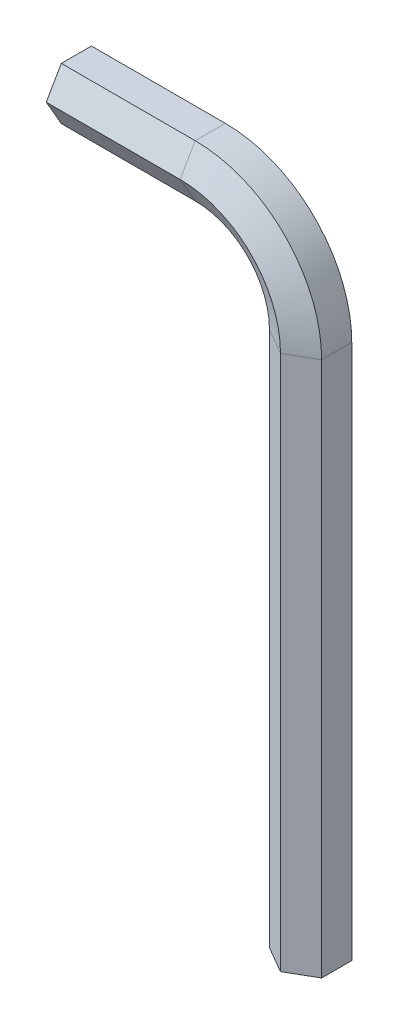
ISO-10303-21;
HEADER;
FILE_DESCRIPTION(('STEP AP214'),'2;1');
FILE_NAME('part.step','',(''),(''),'','','');
FILE_SCHEMA(('AUTOMOTIVE_DESIGN { 1 0 10303 214 1 1 1 1 }'));
ENDSEC;
DATA;
#1=APPLICATION_CONTEXT('core data for automotive mechanical design processes');
#2=APPLICATION_PROTOCOL_DEFINITION('international standard','automotive_design',2000,#1);
#3=PRODUCT_CONTEXT('',#1,'mechanical');
#4=PRODUCT('Part','Part','',(#3));
#5=PRODUCT_RELATED_PRODUCT_CATEGORY('part','',(#4));
#6=PRODUCT_DEFINITION_FORMATION('','',#4);
#7=PRODUCT_DEFINITION_CONTEXT('part definition',#1,'design');
#8=PRODUCT_DEFINITION('design','',#6,#7);
#9=PRODUCT_DEFINITION_SHAPE('','',#8);
#10=(LENGTH_UNIT() NAMED_UNIT(*) SI_UNIT(.MILLI.,.METRE.));
#11=(NAMED_UNIT(*) PLANE_ANGLE_UNIT() SI_UNIT($,.RADIAN.));
#12=(NAMED_UNIT(*) SI_UNIT($,.STERADIAN.) SOLID_ANGLE_UNIT());
#13=UNCERTAINTY_MEASURE_WITH_UNIT(LENGTH_MEASURE(1.E-05),#10,'distance_accuracy_value','');
#14=(GEOMETRIC_REPRESENTATION_CONTEXT(3) GLOBAL_UNCERTAINTY_ASSIGNED_CONTEXT((#13)) GLOBAL_UNIT_ASSIGNED_CONTEXT((#10,
#11,#12)) REPRESENTATION_CONTEXT('',''));
#15=CARTESIAN_POINT('',(0.,0.,0.));
#16=DIRECTION('',(0.,0.,1.));
#17=DIRECTION('',(1.,0.,0.));
#18=AXIS2_PLACEMENT_3D('',#15,#16,#17);
#19=CARTESIAN_POINT('',(-95.,0.,0.));
#20=DIRECTION('',(0.,1.,0.));
#21=DIRECTION('',(0.,0.,1.));
#22=AXIS2_PLACEMENT_3D('',#19,#20,#21);
#23=PLANE('',#22);
#24=DIRECTION('',(0.866025403784439,0.,0.5));
#25=VECTOR('',#24,1.);
#26=CARTESIAN_POINT('',(-3.89711431702998,0.,2.24999999999999));
#27=LINE('',#26,#25);
#28=CARTESIAN_POINT('',(-3.89711431702998,0.,2.24999999999999));
#29=VERTEX_POINT('',#28);
#30=CARTESIAN_POINT('',(0.,0.,4.49999999999999));
#31=VERTEX_POINT('',#30);
#32=EDGE_CURVE('E196',#29,#31,#27,.T.);
#33=ORIENTED_EDGE('',*,*,#32,.F.);
#34=DIRECTION('',(0.,0.,1.));
#35=VECTOR('',#34,1.);
#36=CARTESIAN_POINT('',(-3.89711431702997,0.,-2.25));
#37=LINE('',#36,#35);
#38=CARTESIAN_POINT('',(-3.89711431702997,0.,-2.25));
#39=VERTEX_POINT('',#38);
#40=EDGE_CURVE('E258',#39,#29,#37,.T.);
#41=ORIENTED_EDGE('',*,*,#40,.F.);
#42=DIRECTION('',(-0.866025403784438,0.,0.5));
#43=VECTOR('',#42,1.);
#44=CARTESIAN_POINT('',(0.,0.,-4.5));
#45=LINE('',#44,#43);
#46=CARTESIAN_POINT('',(0.,0.,-4.5));
#47=VERTEX_POINT('',#46);
#48=EDGE_CURVE('E238',#47,#39,#45,.T.);
#49=ORIENTED_EDGE('',*,*,#48,.F.);
#50=DIRECTION('',(-0.866025403784439,0.,-0.499999999999999));
#51=VECTOR('',#50,1.);
#52=CARTESIAN_POINT('',(3.89711431702998,0.,-2.25));
#53=LINE('',#52,#51);
#54=CARTESIAN_POINT('',(3.89711431702998,0.,-2.25));
#55=VERTEX_POINT('',#54);
#56=EDGE_CURVE('E142',#55,#47,#53,.T.);
#57=ORIENTED_EDGE('',*,*,#56,.F.);
#58=DIRECTION('',(0.,0.,-1.));
#59=VECTOR('',#58,1.);
#60=CARTESIAN_POINT('',(3.89711431702997,0.,2.25));
#61=LINE('',#60,#59);
#62=CARTESIAN_POINT('',(3.89711431702997,0.,2.25));
#63=VERTEX_POINT('',#62);
#64=EDGE_CURVE('E146',#63,#55,#61,.T.);
#65=ORIENTED_EDGE('',*,*,#64,.F.);
#66=DIRECTION('',(0.866025403784438,0.,-0.5));
#67=VECTOR('',#66,1.);
#68=CARTESIAN_POINT('',(0.,0.,4.49999999999999));
#69=LINE('',#68,#67);
#70=EDGE_CURVE('E151',#31,#63,#69,.T.);
#71=ORIENTED_EDGE('',*,*,#70,.F.);
#72=EDGE_LOOP('',(#33,#41,#49,#57,#65,#71));
#73=FACE_BOUND('',#72,.T.);
#74=ADVANCED_FACE('F40',(#73),#23,.F.);
#75=CARTESIAN_POINT('',(-35.,0.,0.));
#76=DIRECTION('',(-1.,0.,0.));
#77=DIRECTION('',(0.,0.,1.));
#78=AXIS2_PLACEMENT_3D('',#75,#76,#77);
#79=PLANE('',#78);
#80=DIRECTION('',(0.,0.866025403784439,0.5));
#81=VECTOR('',#80,1.);
#82=CARTESIAN_POINT('',(-35.,91.10288568297,2.24999999999999));
#83=LINE('',#82,#81);
#84=CARTESIAN_POINT('',(-35.,91.10288568297,2.24999999999999));
#85=VERTEX_POINT('',#84);
#86=CARTESIAN_POINT('',(-35.,95.,4.49999999999999));
#87=VERTEX_POINT('',#86);
#88=EDGE_CURVE('E162',#85,#87,#83,.T.);
#89=ORIENTED_EDGE('',*,*,#88,.T.);
#90=DIRECTION('',(0.,0.866025403784438,-0.5));
#91=VECTOR('',#90,1.);
#92=CARTESIAN_POINT('',(-35.,95.,4.49999999999999));
#93=LINE('',#92,#91);
#94=CARTESIAN_POINT('',(-35.,98.89711431703,2.25));
#95=VERTEX_POINT('',#94);
#96=EDGE_CURVE('E165',#87,#95,#93,.T.);
#97=ORIENTED_EDGE('',*,*,#96,.T.);
#98=DIRECTION('',(0.,0.,-1.));
#99=VECTOR('',#98,1.);
#100=CARTESIAN_POINT('',(-35.,98.89711431703,2.25));
#101=LINE('',#100,#99);
#102=CARTESIAN_POINT('',(-35.,98.89711431703,-2.25));
#103=VERTEX_POINT('',#102);
#104=EDGE_CURVE('E216',#95,#103,#101,.T.);
#105=ORIENTED_EDGE('',*,*,#104,.T.);
#106=DIRECTION('',(0.,-0.866025403784439,-0.499999999999999));
#107=VECTOR('',#106,1.);
#108=CARTESIAN_POINT('',(-35.,98.89711431703,-2.25));
#109=LINE('',#108,#107);
#110=CARTESIAN_POINT('',(-35.,95.,-4.5));
#111=VERTEX_POINT('',#110);
#112=EDGE_CURVE('E60',#103,#111,#109,.T.);
#113=ORIENTED_EDGE('',*,*,#112,.T.);
#114=DIRECTION('',(0.,-0.866025403784438,0.5));
#115=VECTOR('',#114,1.);
#116=CARTESIAN_POINT('',(-35.,95.,-4.5));
#117=LINE('',#116,#115);
#118=CARTESIAN_POINT('',(-35.,91.10288568297,-2.25));
#119=VERTEX_POINT('',#118);
#120=EDGE_CURVE('E54',#111,#119,#117,.T.);
#121=ORIENTED_EDGE('',*,*,#120,.T.);
#122=DIRECTION('',(0.,0.,1.));
#123=VECTOR('',#122,1.);
#124=CARTESIAN_POINT('',(-35.,91.10288568297,-2.25));
#125=LINE('',#124,#123);
#126=EDGE_CURVE('E11',#119,#85,#125,.T.);
#127=ORIENTED_EDGE('',*,*,#126,.T.);
#128=EDGE_LOOP('',(#89,#97,#105,#113,#121,#127));
#129=FACE_BOUND('',#128,.T.);
#130=ADVANCED_FACE('F164',(#129),#79,.T.);
#131=CARTESIAN_POINT('',(-3.89711431702998,0.,2.24999999999999));
#132=DIRECTION('',(-0.5,0.,0.866025403784439));
#133=DIRECTION('',(0.866025403784439,0.,0.5));
#134=AXIS2_PLACEMENT_3D('',#131,#132,#133);
#135=PLANE('',#134);
#136=DIRECTION('',(0.,1.,0.));
#137=VECTOR('',#136,1.);
#138=CARTESIAN_POINT('',(0.,0.,4.49999999999999));
#139=LINE('',#138,#137);
#140=CARTESIAN_POINT('',(0.,80.,4.49999999999999));
#141=VERTEX_POINT('',#140);
#142=EDGE_CURVE('E202',#31,#141,#139,.T.);
#143=ORIENTED_EDGE('',*,*,#142,.T.);
#144=DIRECTION('',(0.866025403784439,0.,0.5));
#145=VECTOR('',#144,1.);
#146=CARTESIAN_POINT('',(-3.89711431702998,80.,2.24999999999999));
#147=LINE('',#146,#145);
#148=CARTESIAN_POINT('',(-3.89711431702998,80.,2.24999999999999));
#149=VERTEX_POINT('',#148);
#150=EDGE_CURVE('E305',#149,#141,#147,.T.);
#151=ORIENTED_EDGE('',*,*,#150,.F.);
#152=DIRECTION('',(0.,1.,0.));
#153=VECTOR('',#152,1.);
#154=CARTESIAN_POINT('',(-3.89711431702998,0.,2.24999999999999));
#155=LINE('',#154,#153);
#156=EDGE_CURVE('E279',#29,#149,#155,.T.);
#157=ORIENTED_EDGE('',*,*,#156,.F.);
#158=ORIENTED_EDGE('',*,*,#32,.T.);
#159=EDGE_LOOP('',(#143,#151,#157,#158));
#160=FACE_BOUND('',#159,.T.);
#161=ADVANCED_FACE('F316',(#160),#135,.T.);
#162=CARTESIAN_POINT('',(0.,0.,4.49999999999999));
#163=DIRECTION('',(0.5,0.,0.866025403784438));
#164=DIRECTION('',(0.866025403784438,0.,-0.5));
#165=AXIS2_PLACEMENT_3D('',#162,#163,#164);
#166=PLANE('',#165);
#167=DIRECTION('',(0.,1.,0.));
#168=VECTOR('',#167,1.);
#169=CARTESIAN_POINT('',(3.89711431702997,0.,2.25));
#170=LINE('',#169,#168);
#171=CARTESIAN_POINT('',(3.89711431702997,80.,2.25));
#172=VERTEX_POINT('',#171);
#173=EDGE_CURVE('E201',#63,#172,#170,.T.);
#174=ORIENTED_EDGE('',*,*,#173,.T.);
#175=DIRECTION('',(0.866025403784438,0.,-0.5));
#176=VECTOR('',#175,1.);
#177=CARTESIAN_POINT('',(0.,80.,4.49999999999999));
#178=LINE('',#177,#176);
#179=EDGE_CURVE('E197',#141,#172,#178,.T.);
#180=ORIENTED_EDGE('',*,*,#179,.F.);
#181=ORIENTED_EDGE('',*,*,#142,.F.);
#182=ORIENTED_EDGE('',*,*,#70,.T.);
#183=EDGE_LOOP('',(#174,#180,#181,#182));
#184=FACE_BOUND('',#183,.T.);
#185=ADVANCED_FACE('F319',(#184),#166,.T.);
#186=CARTESIAN_POINT('',(3.89711431702997,0.,2.25));
#187=DIRECTION('',(1.,0.,0.));
#188=DIRECTION('',(0.,0.,-1.));
#189=AXIS2_PLACEMENT_3D('',#186,#187,#188);
#190=PLANE('',#189);
#191=DIRECTION('',(0.,1.,0.));
#192=VECTOR('',#191,1.);
#193=CARTESIAN_POINT('',(3.89711431702998,0.,-2.25));
#194=LINE('',#193,#192);
#195=CARTESIAN_POINT('',(3.89711431702998,80.,-2.25));
#196=VERTEX_POINT('',#195);
#197=EDGE_CURVE('E221',#55,#196,#194,.T.);
#198=ORIENTED_EDGE('',*,*,#197,.T.);
#199=DIRECTION('',(0.,0.,-1.));
#200=VECTOR('',#199,1.);
#201=CARTESIAN_POINT('',(3.89711431702997,80.,2.25));
#202=LINE('',#201,#200);
#203=EDGE_CURVE('E206',#172,#196,#202,.T.);
#204=ORIENTED_EDGE('',*,*,#203,.F.);
#205=ORIENTED_EDGE('',*,*,#173,.F.);
#206=ORIENTED_EDGE('',*,*,#64,.T.);
#207=EDGE_LOOP('',(#198,#204,#205,#206));
#208=FACE_BOUND('',#207,.T.);
#209=ADVANCED_FACE('F373',(#208),#190,.T.);
#210=CARTESIAN_POINT('',(3.89711431702998,0.,-2.25));
#211=DIRECTION('',(0.499999999999999,0.,-0.866025403784439));
#212=DIRECTION('',(-0.866025403784439,0.,-0.499999999999999));
#213=AXIS2_PLACEMENT_3D('',#210,#211,#212);
#214=PLANE('',#213);
#215=DIRECTION('',(0.,1.,0.));
#216=VECTOR('',#215,1.);
#217=CARTESIAN_POINT('',(0.,0.,-4.5));
#218=LINE('',#217,#216);
#219=CARTESIAN_POINT('',(0.,80.,-4.5));
#220=VERTEX_POINT('',#219);
#221=EDGE_CURVE('E241',#47,#220,#218,.T.);
#222=ORIENTED_EDGE('',*,*,#221,.T.);
#223=DIRECTION('',(-0.866025403784439,0.,-0.499999999999999));
#224=VECTOR('',#223,1.);
#225=CARTESIAN_POINT('',(3.89711431702998,80.,-2.25));
#226=LINE('',#225,#224);
#227=EDGE_CURVE('E225',#196,#220,#226,.T.);
#228=ORIENTED_EDGE('',*,*,#227,.F.);
#229=ORIENTED_EDGE('',*,*,#197,.F.);
#230=ORIENTED_EDGE('',*,*,#56,.T.);
#231=EDGE_LOOP('',(#222,#228,#229,#230));
#232=FACE_BOUND('',#231,.T.);
#233=ADVANCED_FACE('F381',(#232),#214,.T.);
#234=CARTESIAN_POINT('',(0.,0.,-4.5));
#235=DIRECTION('',(-0.5,0.,-0.866025403784438));
#236=DIRECTION('',(-0.866025403784438,0.,0.5));
#237=AXIS2_PLACEMENT_3D('',#234,#235,#236);
#238=PLANE('',#237);
#239=DIRECTION('',(0.,1.,0.));
#240=VECTOR('',#239,1.);
#241=CARTESIAN_POINT('',(-3.89711431702997,0.,-2.25));
#242=LINE('',#241,#240);
#243=CARTESIAN_POINT('',(-3.89711431702997,80.,-2.25));
#244=VERTEX_POINT('',#243);
#245=EDGE_CURVE('E261',#39,#244,#242,.T.);
#246=ORIENTED_EDGE('',*,*,#245,.T.);
#247=DIRECTION('',(-0.866025403784438,0.,0.5));
#248=VECTOR('',#247,1.);
#249=CARTESIAN_POINT('',(0.,80.,-4.5));
#250=LINE('',#249,#248);
#251=EDGE_CURVE('E245',#220,#244,#250,.T.);
#252=ORIENTED_EDGE('',*,*,#251,.F.);
#253=ORIENTED_EDGE('',*,*,#221,.F.);
#254=ORIENTED_EDGE('',*,*,#48,.T.);
#255=EDGE_LOOP('',(#246,#252,#253,#254));
#256=FACE_BOUND('',#255,.T.);
#257=ADVANCED_FACE('F391',(#256),#238,.T.);
#258=CARTESIAN_POINT('',(-3.89711431702997,0.,-2.25));
#259=DIRECTION('',(-1.,0.,0.));
#260=DIRECTION('',(0.,0.,1.));
#261=AXIS2_PLACEMENT_3D('',#258,#259,#260);
#262=PLANE('',#261);
#263=DIRECTION('',(0.,0.,1.));
#264=VECTOR('',#263,1.);
#265=CARTESIAN_POINT('',(-3.89711431702997,80.,-2.25));
#266=LINE('',#265,#264);
#267=EDGE_CURVE('E265',#244,#149,#266,.T.);
#268=ORIENTED_EDGE('',*,*,#267,.F.);
#269=ORIENTED_EDGE('',*,*,#245,.F.);
#270=ORIENTED_EDGE('',*,*,#40,.T.);
#271=ORIENTED_EDGE('',*,*,#156,.T.);
#272=EDGE_LOOP('',(#268,#269,#270,#271));
#273=FACE_BOUND('',#272,.T.);
#274=ADVANCED_FACE('F332',(#273),#262,.T.);
#275=CARTESIAN_POINT('',(-15.,80.,2.24999999999999));
#276=DIRECTION('',(0.,0.,1.));
#277=DIRECTION('',(1.,0.,0.));
#278=AXIS2_PLACEMENT_3D('',#275,#276,#277);
#279=CONICAL_SURFACE('',#278,11.10288568297,1.0471975511966);
#280=CARTESIAN_POINT('',(-15.,80.,4.49999999999999));
#281=DIRECTION('',(0.,0.,1.));
#282=DIRECTION('',(1.,0.,0.));
#283=AXIS2_PLACEMENT_3D('',#280,#281,#282);
#284=CIRCLE('',#283,15.);
#285=CARTESIAN_POINT('',(-14.9999999999999,95.,4.49999999999999));
#286=VERTEX_POINT('',#285);
#287=EDGE_CURVE('E210',#141,#286,#284,.T.);
#288=ORIENTED_EDGE('',*,*,#287,.T.);
#289=DIRECTION('',(0.,0.866025403784439,0.5));
#290=VECTOR('',#289,1.);
#291=CARTESIAN_POINT('',(-14.9999999999999,91.1028856829701,2.24999999999999));
#292=LINE('',#291,#290);
#293=CARTESIAN_POINT('',(-14.9999999999999,91.10288568297,2.24999999999999));
#294=VERTEX_POINT('',#293);
#295=EDGE_CURVE('E185',#294,#286,#292,.T.);
#296=ORIENTED_EDGE('',*,*,#295,.F.);
#297=CARTESIAN_POINT('',(-15.,80.,2.24999999999999));
#298=DIRECTION('',(0.,0.,1.));
#299=DIRECTION('',(1.,0.,0.));
#300=AXIS2_PLACEMENT_3D('',#297,#298,#299);
#301=CIRCLE('',#300,11.10288568297);
#302=EDGE_CURVE('E282',#149,#294,#301,.T.);
#303=ORIENTED_EDGE('',*,*,#302,.F.);
#304=ORIENTED_EDGE('',*,*,#150,.T.);
#305=EDGE_LOOP('',(#288,#296,#303,#304));
#306=FACE_BOUND('',#305,.T.);
#307=ADVANCED_FACE('F290',(#306),#279,.F.);
#308=CARTESIAN_POINT('',(-15.,80.,4.49999999999999));
#309=DIRECTION('',(0.,0.,-1.));
#310=DIRECTION('',(-1.,0.,0.));
#311=AXIS2_PLACEMENT_3D('',#308,#309,#310);
#312=CONICAL_SURFACE('',#311,15.,1.0471975511966);
#313=CARTESIAN_POINT('',(-15.,80.,2.25));
#314=DIRECTION('',(0.,0.,1.));
#315=DIRECTION('',(1.,0.,0.));
#316=AXIS2_PLACEMENT_3D('',#313,#314,#315);
#317=CIRCLE('',#316,18.89711431703);
#318=CARTESIAN_POINT('',(-14.9999999999999,98.89711431703,2.25));
#319=VERTEX_POINT('',#318);
#320=EDGE_CURVE('E129',#172,#319,#317,.T.);
#321=ORIENTED_EDGE('',*,*,#320,.T.);
#322=DIRECTION('',(0.,0.866025403784438,-0.5));
#323=VECTOR('',#322,1.);
#324=CARTESIAN_POINT('',(-14.9999999999999,95.,4.49999999999999));
#325=LINE('',#324,#323);
#326=EDGE_CURVE('E207',#286,#319,#325,.T.);
#327=ORIENTED_EDGE('',*,*,#326,.F.);
#328=ORIENTED_EDGE('',*,*,#287,.F.);
#329=ORIENTED_EDGE('',*,*,#179,.T.);
#330=EDGE_LOOP('',(#321,#327,#328,#329));
#331=FACE_BOUND('',#330,.T.);
#332=ADVANCED_FACE('F322',(#331),#312,.T.);
#333=CARTESIAN_POINT('',(-15.,80.,0.));
#334=DIRECTION('',(0.,0.,1.));
#335=DIRECTION('',(1.,0.,0.));
#336=AXIS2_PLACEMENT_3D('',#333,#334,#335);
#337=CYLINDRICAL_SURFACE('',#336,18.89711431703);
#338=CARTESIAN_POINT('',(-15.,80.,-2.25));
#339=DIRECTION('',(0.,0.,1.));
#340=DIRECTION('',(1.,0.,0.));
#341=AXIS2_PLACEMENT_3D('',#338,#339,#340);
#342=CIRCLE('',#341,18.89711431703);
#343=CARTESIAN_POINT('',(-14.9999999999999,98.89711431703,-2.25));
#344=VERTEX_POINT('',#343);
#345=EDGE_CURVE('E120',#196,#344,#342,.T.);
#346=ORIENTED_EDGE('',*,*,#345,.T.);
#347=DIRECTION('',(0.,0.,-1.));
#348=VECTOR('',#347,1.);
#349=CARTESIAN_POINT('',(-14.9999999999999,98.89711431703,2.25));
#350=LINE('',#349,#348);
#351=EDGE_CURVE('E212',#319,#344,#350,.T.);
#352=ORIENTED_EDGE('',*,*,#351,.F.);
#353=ORIENTED_EDGE('',*,*,#320,.F.);
#354=ORIENTED_EDGE('',*,*,#203,.T.);
#355=EDGE_LOOP('',(#346,#352,#353,#354));
#356=FACE_BOUND('',#355,.T.);
#357=ADVANCED_FACE('F324',(#356),#337,.T.);
#358=CARTESIAN_POINT('',(-15.,80.,-2.25));
#359=DIRECTION('',(0.,0.,1.));
#360=DIRECTION('',(1.,0.,0.));
#361=AXIS2_PLACEMENT_3D('',#358,#359,#360);
#362=CONICAL_SURFACE('',#361,18.89711431703,1.0471975511966);
#363=CARTESIAN_POINT('',(-15.,80.,-4.5));
#364=DIRECTION('',(0.,0.,1.));
#365=DIRECTION('',(1.,0.,0.));
#366=AXIS2_PLACEMENT_3D('',#363,#364,#365);
#367=CIRCLE('',#366,15.);
#368=CARTESIAN_POINT('',(-14.9999999999999,95.,-4.5));
#369=VERTEX_POINT('',#368);
#370=EDGE_CURVE('E113',#220,#369,#367,.T.);
#371=ORIENTED_EDGE('',*,*,#370,.T.);
#372=DIRECTION('',(0.,-0.866025403784439,-0.499999999999999));
#373=VECTOR('',#372,1.);
#374=CARTESIAN_POINT('',(-14.9999999999999,98.89711431703,-2.25));
#375=LINE('',#374,#373);
#376=EDGE_CURVE('E231',#344,#369,#375,.T.);
#377=ORIENTED_EDGE('',*,*,#376,.F.);
#378=ORIENTED_EDGE('',*,*,#345,.F.);
#379=ORIENTED_EDGE('',*,*,#227,.T.);
#380=EDGE_LOOP('',(#371,#377,#378,#379));
#381=FACE_BOUND('',#380,.T.);
#382=ADVANCED_FACE('F330',(#381),#362,.T.);
#383=CARTESIAN_POINT('',(-15.,80.,-4.5));
#384=DIRECTION('',(0.,0.,-1.));
#385=DIRECTION('',(-1.,0.,0.));
#386=AXIS2_PLACEMENT_3D('',#383,#384,#385);
#387=CONICAL_SURFACE('',#386,15.,1.0471975511966);
#388=CARTESIAN_POINT('',(-15.,80.,-2.25));
#389=DIRECTION('',(0.,0.,1.));
#390=DIRECTION('',(1.,0.,0.));
#391=AXIS2_PLACEMENT_3D('',#388,#389,#390);
#392=CIRCLE('',#391,11.10288568297);
#393=CARTESIAN_POINT('',(-14.9999999999999,91.10288568297,-2.25));
#394=VERTEX_POINT('',#393);
#395=EDGE_CURVE('E268',#244,#394,#392,.T.);
#396=ORIENTED_EDGE('',*,*,#395,.T.);
#397=DIRECTION('',(0.,-0.866025403784438,0.5));
#398=VECTOR('',#397,1.);
#399=CARTESIAN_POINT('',(-14.9999999999999,95.,-4.5));
#400=LINE('',#399,#398);
#401=EDGE_CURVE('E250',#369,#394,#400,.T.);
#402=ORIENTED_EDGE('',*,*,#401,.F.);
#403=ORIENTED_EDGE('',*,*,#370,.F.);
#404=ORIENTED_EDGE('',*,*,#251,.T.);
#405=EDGE_LOOP('',(#396,#402,#403,#404));
#406=FACE_BOUND('',#405,.T.);
#407=ADVANCED_FACE('F432',(#406),#387,.F.);
#408=CARTESIAN_POINT('',(-15.,80.,0.));
#409=DIRECTION('',(0.,0.,1.));
#410=DIRECTION('',(1.,0.,0.));
#411=AXIS2_PLACEMENT_3D('',#408,#409,#410);
#412=CYLINDRICAL_SURFACE('',#411,11.10288568297);
#413=DIRECTION('',(0.,0.,1.));
#414=VECTOR('',#413,1.);
#415=CARTESIAN_POINT('',(-14.9999999999999,91.1028856829701,-2.25));
#416=LINE('',#415,#414);
#417=EDGE_CURVE('E193',#394,#294,#416,.T.);
#418=ORIENTED_EDGE('',*,*,#417,.F.);
#419=ORIENTED_EDGE('',*,*,#395,.F.);
#420=ORIENTED_EDGE('',*,*,#267,.T.);
#421=ORIENTED_EDGE('',*,*,#302,.T.);
#422=EDGE_LOOP('',(#418,#419,#420,#421));
#423=FACE_BOUND('',#422,.T.);
#424=ADVANCED_FACE('F294',(#423),#412,.F.);
#425=CARTESIAN_POINT('',(-15.,91.10288568297,2.24999999999999));
#426=DIRECTION('',(0.,-0.5,0.866025403784439));
#427=DIRECTION('',(0.,-0.866025403784439,-0.5));
#428=AXIS2_PLACEMENT_3D('',#425,#426,#427);
#429=PLANE('',#428);
#430=DIRECTION('',(-1.,0.,0.));
#431=VECTOR('',#430,1.);
#432=CARTESIAN_POINT('',(-15.,95.,4.49999999999999));
#433=LINE('',#432,#431);
#434=EDGE_CURVE('E171',#286,#87,#433,.T.);
#435=ORIENTED_EDGE('',*,*,#434,.T.);
#436=ORIENTED_EDGE('',*,*,#88,.F.);
#437=DIRECTION('',(-1.,0.,0.));
#438=VECTOR('',#437,1.);
#439=CARTESIAN_POINT('',(-15.,91.10288568297,2.24999999999999));
#440=LINE('',#439,#438);
#441=EDGE_CURVE('E172',#294,#85,#440,.T.);
#442=ORIENTED_EDGE('',*,*,#441,.F.);
#443=ORIENTED_EDGE('',*,*,#295,.T.);
#444=EDGE_LOOP('',(#435,#436,#442,#443));
#445=FACE_BOUND('',#444,.T.);
#446=ADVANCED_FACE('F183',(#445),#429,.T.);
#447=CARTESIAN_POINT('',(-15.,95.,4.49999999999999));
#448=DIRECTION('',(0.,0.5,0.866025403784438));
#449=DIRECTION('',(0.,-0.866025403784438,0.5));
#450=AXIS2_PLACEMENT_3D('',#447,#448,#449);
#451=PLANE('',#450);
#452=DIRECTION('',(-1.,0.,0.));
#453=VECTOR('',#452,1.);
#454=CARTESIAN_POINT('',(-15.,98.89711431703,2.25));
#455=LINE('',#454,#453);
#456=EDGE_CURVE('E179',#319,#95,#455,.T.);
#457=ORIENTED_EDGE('',*,*,#456,.T.);
#458=ORIENTED_EDGE('',*,*,#96,.F.);
#459=ORIENTED_EDGE('',*,*,#434,.F.);
#460=ORIENTED_EDGE('',*,*,#326,.T.);
#461=EDGE_LOOP('',(#457,#458,#459,#460));
#462=FACE_BOUND('',#461,.T.);
#463=ADVANCED_FACE('F176',(#462),#451,.T.);
#464=CARTESIAN_POINT('',(-15.,98.89711431703,2.25));
#465=DIRECTION('',(0.,1.,0.));
#466=DIRECTION('',(0.,0.,1.));
#467=AXIS2_PLACEMENT_3D('',#464,#465,#466);
#468=PLANE('',#467);
#469=DIRECTION('',(-1.,0.,0.));
#470=VECTOR('',#469,1.);
#471=CARTESIAN_POINT('',(-15.,98.89711431703,-2.25));
#472=LINE('',#471,#470);
#473=EDGE_CURVE('E98',#344,#103,#472,.T.);
#474=ORIENTED_EDGE('',*,*,#473,.T.);
#475=ORIENTED_EDGE('',*,*,#104,.F.);
#476=ORIENTED_EDGE('',*,*,#456,.F.);
#477=ORIENTED_EDGE('',*,*,#351,.T.);
#478=EDGE_LOOP('',(#474,#475,#476,#477));
#479=FACE_BOUND('',#478,.T.);
#480=ADVANCED_FACE('F460',(#479),#468,.T.);
#481=CARTESIAN_POINT('',(-15.,98.89711431703,-2.25));
#482=DIRECTION('',(0.,0.499999999999999,-0.866025403784439));
#483=DIRECTION('',(0.,0.866025403784439,0.499999999999999));
#484=AXIS2_PLACEMENT_3D('',#481,#482,#483);
#485=PLANE('',#484);
#486=DIRECTION('',(-1.,0.,0.));
#487=VECTOR('',#486,1.);
#488=CARTESIAN_POINT('',(-15.,95.,-4.5));
#489=LINE('',#488,#487);
#490=EDGE_CURVE('E90',#369,#111,#489,.T.);
#491=ORIENTED_EDGE('',*,*,#490,.T.);
#492=ORIENTED_EDGE('',*,*,#112,.F.);
#493=ORIENTED_EDGE('',*,*,#473,.F.);
#494=ORIENTED_EDGE('',*,*,#376,.T.);
#495=EDGE_LOOP('',(#491,#492,#493,#494));
#496=FACE_BOUND('',#495,.T.);
#497=ADVANCED_FACE('F342',(#496),#485,.T.);
#498=CARTESIAN_POINT('',(-15.,95.,-4.5));
#499=DIRECTION('',(0.,-0.5,-0.866025403784438));
#500=DIRECTION('',(0.,0.866025403784439,-0.5));
#501=AXIS2_PLACEMENT_3D('',#498,#499,#500);
#502=PLANE('',#501);
#503=DIRECTION('',(-1.,0.,0.));
#504=VECTOR('',#503,1.);
#505=CARTESIAN_POINT('',(-15.,91.10288568297,-2.25));
#506=LINE('',#505,#504);
#507=EDGE_CURVE('E48',#394,#119,#506,.T.);
#508=ORIENTED_EDGE('',*,*,#507,.T.);
#509=ORIENTED_EDGE('',*,*,#120,.F.);
#510=ORIENTED_EDGE('',*,*,#490,.F.);
#511=ORIENTED_EDGE('',*,*,#401,.T.);
#512=EDGE_LOOP('',(#508,#509,#510,#511));
#513=FACE_BOUND('',#512,.T.);
#514=ADVANCED_FACE('F337',(#513),#502,.T.);
#515=CARTESIAN_POINT('',(-15.,91.10288568297,-2.25));
#516=DIRECTION('',(0.,-1.,0.));
#517=DIRECTION('',(0.,0.,-1.));
#518=AXIS2_PLACEMENT_3D('',#515,#516,#517);
#519=PLANE('',#518);
#520=ORIENTED_EDGE('',*,*,#126,.F.);
#521=ORIENTED_EDGE('',*,*,#507,.F.);
#522=ORIENTED_EDGE('',*,*,#417,.T.);
#523=ORIENTED_EDGE('',*,*,#441,.T.);
#524=EDGE_LOOP('',(#520,#521,#522,#523));
#525=FACE_BOUND('',#524,.T.);
#526=ADVANCED_FACE('F285',(#525),#519,.T.);
#527=CLOSED_SHELL('',(#74,#130,#161,#185,#209,#233,#257,#274,#307,#332,#357,#382,#407,#424,#446,
#463,#480,#497,#514,#526));
#528=MANIFOLD_SOLID_BREP('B2',#527);
#529=ADVANCED_BREP_SHAPE_REPRESENTATION('',(#18,#528),#14);
#530=SHAPE_DEFINITION_REPRESENTATION(#9,#529);
ENDSEC;
END-ISO-10303-21;
